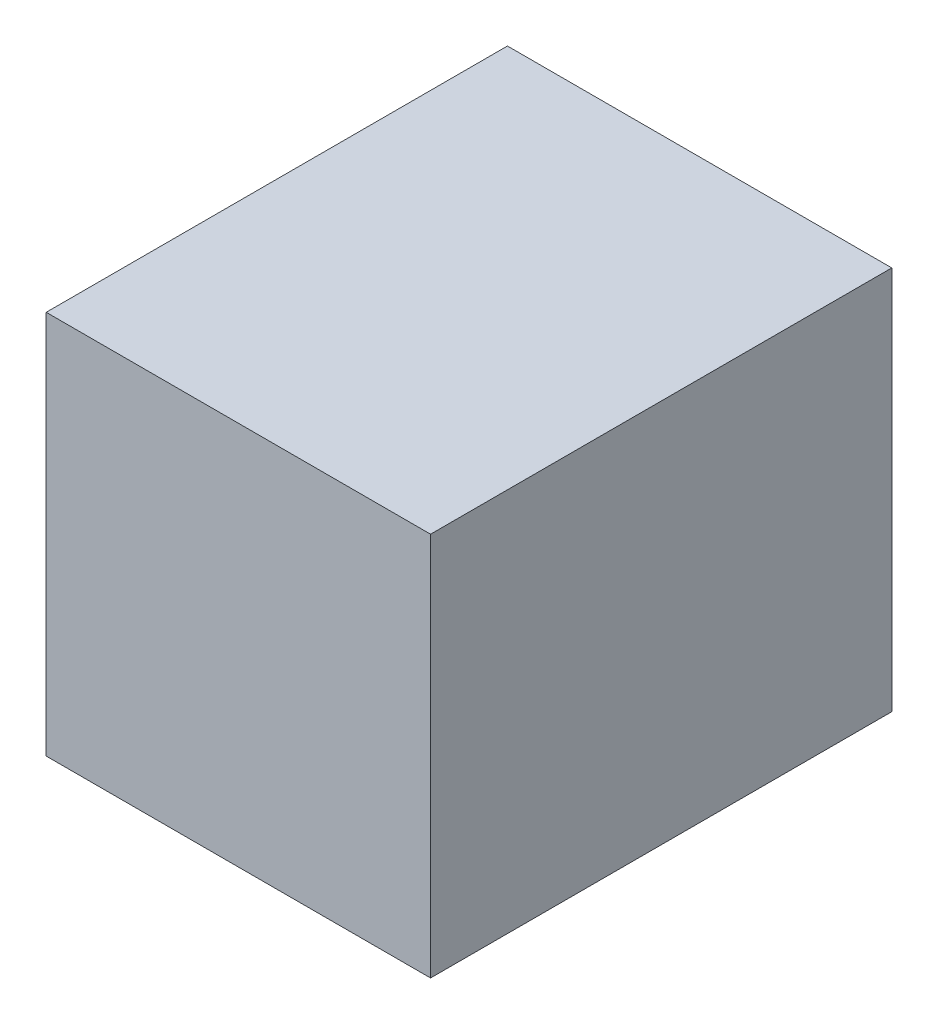
ISO-10303-21;
HEADER;
FILE_DESCRIPTION(('STEP AP214'),'2;1');
FILE_NAME('part.step','',(''),(''),'','','');
FILE_SCHEMA(('AUTOMOTIVE_DESIGN { 1 0 10303 214 1 1 1 1 }'));
ENDSEC;
DATA;
#1=APPLICATION_CONTEXT('core data for automotive mechanical design processes');
#2=APPLICATION_PROTOCOL_DEFINITION('international standard','automotive_design',2000,#1);
#3=PRODUCT_CONTEXT('',#1,'mechanical');
#4=PRODUCT('Part','Part','',(#3));
#5=PRODUCT_RELATED_PRODUCT_CATEGORY('part','',(#4));
#6=PRODUCT_DEFINITION_FORMATION('','',#4);
#7=PRODUCT_DEFINITION_CONTEXT('part definition',#1,'design');
#8=PRODUCT_DEFINITION('design','',#6,#7);
#9=PRODUCT_DEFINITION_SHAPE('','',#8);
#10=(LENGTH_UNIT() NAMED_UNIT(*) SI_UNIT(.MILLI.,.METRE.));
#11=(NAMED_UNIT(*) PLANE_ANGLE_UNIT() SI_UNIT($,.RADIAN.));
#12=(NAMED_UNIT(*) SI_UNIT($,.STERADIAN.) SOLID_ANGLE_UNIT());
#13=UNCERTAINTY_MEASURE_WITH_UNIT(LENGTH_MEASURE(1.E-05),#10,'distance_accuracy_value','');
#14=(GEOMETRIC_REPRESENTATION_CONTEXT(3) GLOBAL_UNCERTAINTY_ASSIGNED_CONTEXT((#13)) GLOBAL_UNIT_ASSIGNED_CONTEXT((#10,
#11,#12)) REPRESENTATION_CONTEXT('',''));
#15=CARTESIAN_POINT('',(0.,0.,0.));
#16=DIRECTION('',(0.,0.,1.));
#17=DIRECTION('',(1.,0.,0.));
#18=AXIS2_PLACEMENT_3D('',#15,#16,#17);
#19=CARTESIAN_POINT('',(125.,250.,150.));
#20=DIRECTION('',(-1.,0.,0.));
#21=DIRECTION('',(0.,0.,1.));
#22=AXIS2_PLACEMENT_3D('',#19,#20,#21);
#23=PLANE('',#22);
#24=DIRECTION('',(0.,0.,-1.));
#25=VECTOR('',#24,1.);
#26=CARTESIAN_POINT('',(125.,0.,150.));
#27=LINE('',#26,#25);
#28=CARTESIAN_POINT('',(125.,0.,150.));
#29=VERTEX_POINT('',#28);
#30=CARTESIAN_POINT('',(125.,0.,-150.));
#31=VERTEX_POINT('',#30);
#32=EDGE_CURVE('E100',#29,#31,#27,.T.);
#33=ORIENTED_EDGE('',*,*,#32,.T.);
#34=DIRECTION('',(0.,-1.,0.));
#35=VECTOR('',#34,1.);
#36=CARTESIAN_POINT('',(125.,250.,-150.));
#37=LINE('',#36,#35);
#38=CARTESIAN_POINT('',(125.,250.,-150.));
#39=VERTEX_POINT('',#38);
#40=EDGE_CURVE('E11',#39,#31,#37,.T.);
#41=ORIENTED_EDGE('',*,*,#40,.F.);
#42=DIRECTION('',(0.,0.,-1.));
#43=VECTOR('',#42,1.);
#44=CARTESIAN_POINT('',(125.,250.,150.));
#45=LINE('',#44,#43);
#46=CARTESIAN_POINT('',(125.,250.,150.));
#47=VERTEX_POINT('',#46);
#48=EDGE_CURVE('E88',#47,#39,#45,.T.);
#49=ORIENTED_EDGE('',*,*,#48,.F.);
#50=DIRECTION('',(0.,-1.,0.));
#51=VECTOR('',#50,1.);
#52=CARTESIAN_POINT('',(125.,250.,150.));
#53=LINE('',#52,#51);
#54=EDGE_CURVE('E96',#47,#29,#53,.T.);
#55=ORIENTED_EDGE('',*,*,#54,.T.);
#56=EDGE_LOOP('',(#33,#41,#49,#55));
#57=FACE_BOUND('',#56,.T.);
#58=ADVANCED_FACE('F37',(#57),#23,.F.);
#59=CARTESIAN_POINT('',(-125.,250.,-150.));
#60=DIRECTION('',(0.,0.,1.));
#61=DIRECTION('',(1.,0.,0.));
#62=AXIS2_PLACEMENT_3D('',#59,#60,#61);
#63=PLANE('',#62);
#64=DIRECTION('',(-1.,0.,0.));
#65=VECTOR('',#64,1.);
#66=CARTESIAN_POINT('',(-125.,0.,-150.));
#67=LINE('',#66,#65);
#68=CARTESIAN_POINT('',(-125.,0.,-150.));
#69=VERTEX_POINT('',#68);
#70=EDGE_CURVE('E92',#31,#69,#67,.T.);
#71=ORIENTED_EDGE('',*,*,#70,.T.);
#72=DIRECTION('',(0.,-1.,0.));
#73=VECTOR('',#72,1.);
#74=CARTESIAN_POINT('',(-125.,250.,-150.));
#75=LINE('',#74,#73);
#76=CARTESIAN_POINT('',(-125.,250.,-150.));
#77=VERTEX_POINT('',#76);
#78=EDGE_CURVE('E45',#77,#69,#75,.T.);
#79=ORIENTED_EDGE('',*,*,#78,.F.);
#80=DIRECTION('',(-1.,0.,0.));
#81=VECTOR('',#80,1.);
#82=CARTESIAN_POINT('',(-125.,250.,-150.));
#83=LINE('',#82,#81);
#84=EDGE_CURVE('E83',#39,#77,#83,.T.);
#85=ORIENTED_EDGE('',*,*,#84,.F.);
#86=ORIENTED_EDGE('',*,*,#40,.T.);
#87=EDGE_LOOP('',(#71,#79,#85,#86));
#88=FACE_BOUND('',#87,.T.);
#89=ADVANCED_FACE('F91',(#88),#63,.F.);
#90=CARTESIAN_POINT('',(-125.,250.,150.));
#91=DIRECTION('',(1.,0.,0.));
#92=DIRECTION('',(0.,0.,-1.));
#93=AXIS2_PLACEMENT_3D('',#90,#91,#92);
#94=PLANE('',#93);
#95=DIRECTION('',(0.,0.,1.));
#96=VECTOR('',#95,1.);
#97=CARTESIAN_POINT('',(-125.,0.,150.));
#98=LINE('',#97,#96);
#99=CARTESIAN_POINT('',(-125.,0.,150.));
#100=VERTEX_POINT('',#99);
#101=EDGE_CURVE('E70',#69,#100,#98,.T.);
#102=ORIENTED_EDGE('',*,*,#101,.T.);
#103=DIRECTION('',(0.,-1.,0.));
#104=VECTOR('',#103,1.);
#105=CARTESIAN_POINT('',(-125.,250.,150.));
#106=LINE('',#105,#104);
#107=CARTESIAN_POINT('',(-125.,250.,150.));
#108=VERTEX_POINT('',#107);
#109=EDGE_CURVE('E93',#108,#100,#106,.T.);
#110=ORIENTED_EDGE('',*,*,#109,.F.);
#111=DIRECTION('',(0.,0.,1.));
#112=VECTOR('',#111,1.);
#113=CARTESIAN_POINT('',(-125.,250.,150.));
#114=LINE('',#113,#112);
#115=EDGE_CURVE('E86',#77,#108,#114,.T.);
#116=ORIENTED_EDGE('',*,*,#115,.F.);
#117=ORIENTED_EDGE('',*,*,#78,.T.);
#118=EDGE_LOOP('',(#102,#110,#116,#117));
#119=FACE_BOUND('',#118,.T.);
#120=ADVANCED_FACE('F94',(#119),#94,.F.);
#121=CARTESIAN_POINT('',(-125.,250.,150.));
#122=DIRECTION('',(0.,0.,-1.));
#123=DIRECTION('',(-1.,0.,0.));
#124=AXIS2_PLACEMENT_3D('',#121,#122,#123);
#125=PLANE('',#124);
#126=DIRECTION('',(1.,0.,0.));
#127=VECTOR('',#126,1.);
#128=CARTESIAN_POINT('',(-125.,0.,150.));
#129=LINE('',#128,#127);
#130=EDGE_CURVE('E76',#100,#29,#129,.T.);
#131=ORIENTED_EDGE('',*,*,#130,.T.);
#132=ORIENTED_EDGE('',*,*,#54,.F.);
#133=DIRECTION('',(1.,0.,0.));
#134=VECTOR('',#133,1.);
#135=CARTESIAN_POINT('',(-125.,250.,150.));
#136=LINE('',#135,#134);
#137=EDGE_CURVE('E53',#108,#47,#136,.T.);
#138=ORIENTED_EDGE('',*,*,#137,.F.);
#139=ORIENTED_EDGE('',*,*,#109,.T.);
#140=EDGE_LOOP('',(#131,#132,#138,#139));
#141=FACE_BOUND('',#140,.T.);
#142=ADVANCED_FACE('F107',(#141),#125,.F.);
#143=CARTESIAN_POINT('',(0.,250.,0.));
#144=DIRECTION('',(0.,-1.,0.));
#145=DIRECTION('',(0.,0.,-1.));
#146=AXIS2_PLACEMENT_3D('',#143,#144,#145);
#147=PLANE('',#146);
#148=ORIENTED_EDGE('',*,*,#48,.T.);
#149=ORIENTED_EDGE('',*,*,#84,.T.);
#150=ORIENTED_EDGE('',*,*,#115,.T.);
#151=ORIENTED_EDGE('',*,*,#137,.T.);
#152=EDGE_LOOP('',(#148,#149,#150,#151));
#153=FACE_BOUND('',#152,.T.);
#154=ADVANCED_FACE('F84',(#153),#147,.F.);
#155=CARTESIAN_POINT('',(0.,0.,0.));
#156=DIRECTION('',(0.,-1.,0.));
#157=DIRECTION('',(0.,0.,-1.));
#158=AXIS2_PLACEMENT_3D('',#155,#156,#157);
#159=PLANE('',#158);
#160=ORIENTED_EDGE('',*,*,#32,.F.);
#161=ORIENTED_EDGE('',*,*,#130,.F.);
#162=ORIENTED_EDGE('',*,*,#101,.F.);
#163=ORIENTED_EDGE('',*,*,#70,.F.);
#164=EDGE_LOOP('',(#160,#161,#162,#163));
#165=FACE_BOUND('',#164,.T.);
#166=ADVANCED_FACE('F110',(#165),#159,.T.);
#167=CLOSED_SHELL('',(#58,#89,#120,#142,#154,#166));
#168=MANIFOLD_SOLID_BREP('B2',#167);
#169=ADVANCED_BREP_SHAPE_REPRESENTATION('',(#18,#168),#14);
#170=SHAPE_DEFINITION_REPRESENTATION(#9,#169);
ENDSEC;
END-ISO-10303-21;
